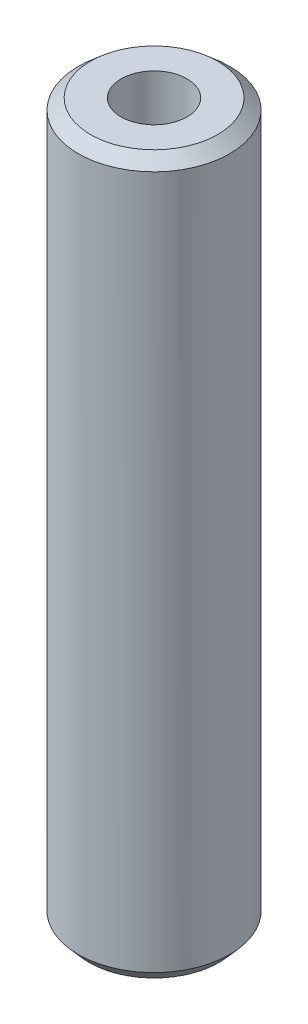
ISO-10303-21;
HEADER;
FILE_DESCRIPTION(('STEP AP214'),'2;1');
FILE_NAME('part.step','',(''),(''),'','','');
FILE_SCHEMA(('AUTOMOTIVE_DESIGN { 1 0 10303 214 1 1 1 1 }'));
ENDSEC;
DATA;
#1=APPLICATION_CONTEXT('core data for automotive mechanical design processes');
#2=APPLICATION_PROTOCOL_DEFINITION('international standard','automotive_design',2000,#1);
#3=PRODUCT_CONTEXT('',#1,'mechanical');
#4=PRODUCT('Part','Part','',(#3));
#5=PRODUCT_RELATED_PRODUCT_CATEGORY('part','',(#4));
#6=PRODUCT_DEFINITION_FORMATION('','',#4);
#7=PRODUCT_DEFINITION_CONTEXT('part definition',#1,'design');
#8=PRODUCT_DEFINITION('design','',#6,#7);
#9=PRODUCT_DEFINITION_SHAPE('','',#8);
#10=(LENGTH_UNIT() NAMED_UNIT(*) SI_UNIT(.MILLI.,.METRE.));
#11=(NAMED_UNIT(*) PLANE_ANGLE_UNIT() SI_UNIT($,.RADIAN.));
#12=(NAMED_UNIT(*) SI_UNIT($,.STERADIAN.) SOLID_ANGLE_UNIT());
#13=UNCERTAINTY_MEASURE_WITH_UNIT(LENGTH_MEASURE(1.E-05),#10,'distance_accuracy_value','');
#14=(GEOMETRIC_REPRESENTATION_CONTEXT(3) GLOBAL_UNCERTAINTY_ASSIGNED_CONTEXT((#13)) GLOBAL_UNIT_ASSIGNED_CONTEXT((#10,
#11,#12)) REPRESENTATION_CONTEXT('',''));
#15=CARTESIAN_POINT('',(0.,0.,0.));
#16=DIRECTION('',(0.,0.,1.));
#17=DIRECTION('',(1.,0.,0.));
#18=AXIS2_PLACEMENT_3D('',#15,#16,#17);
#19=CARTESIAN_POINT('',(0.,212.802195976553,0.));
#20=DIRECTION('',(0.,-1.,0.));
#21=DIRECTION('',(0.,0.,-1.));
#22=AXIS2_PLACEMENT_3D('',#19,#20,#21);
#23=CYLINDRICAL_SURFACE('',#22,22.5);
#24=CARTESIAN_POINT('',(0.,209.668713017492,0.));
#25=DIRECTION('',(0.,1.,0.));
#26=DIRECTION('',(0.,0.,1.));
#27=AXIS2_PLACEMENT_3D('',#24,#25,#26);
#28=CIRCLE('',#27,22.5);
#29=CARTESIAN_POINT('',(0.,209.668713017492,-22.5));
#30=VERTEX_POINT('',#29);
#31=EDGE_CURVE('E50',#30,#30,#28,.F.);
#32=ORIENTED_EDGE('',*,*,#31,.T.);
#33=EDGE_LOOP('',(#32));
#34=FACE_BOUND('',#33,.T.);
#35=CARTESIAN_POINT('',(0.,3.60356855964122,0.));
#36=DIRECTION('',(0.,1.,0.));
#37=DIRECTION('',(0.,0.,1.));
#38=AXIS2_PLACEMENT_3D('',#35,#36,#37);
#39=CIRCLE('',#38,22.5);
#40=CARTESIAN_POINT('',(0.,3.60356855964122,22.5));
#41=VERTEX_POINT('',#40);
#42=EDGE_CURVE('E51',#41,#41,#39,.T.);
#43=ORIENTED_EDGE('',*,*,#42,.T.);
#44=EDGE_LOOP('',(#43));
#45=FACE_BOUND('',#44,.T.);
#46=ADVANCED_FACE('F39',(#34,#45),#23,.T.);
#47=CARTESIAN_POINT('',(0.,212.802195976553,0.));
#48=DIRECTION('',(0.,1.,0.));
#49=DIRECTION('',(0.,0.,1.));
#50=AXIS2_PLACEMENT_3D('',#47,#48,#49);
#51=PLANE('',#50);
#52=CARTESIAN_POINT('',(0.,212.802195976553,0.));
#53=DIRECTION('',(0.,1.,0.));
#54=DIRECTION('',(0.,0.,1.));
#55=AXIS2_PLACEMENT_3D('',#52,#53,#54);
#56=CIRCLE('',#55,18.8964314403588);
#57=CARTESIAN_POINT('',(0.,212.802195976553,-18.8964314403588));
#58=VERTEX_POINT('',#57);
#59=EDGE_CURVE('E54',#58,#58,#56,.T.);
#60=ORIENTED_EDGE('',*,*,#59,.T.);
#61=EDGE_LOOP('',(#60));
#62=FACE_BOUND('',#61,.T.);
#63=CARTESIAN_POINT('',(0.,212.802195976553,0.));
#64=DIRECTION('',(0.,1.,0.));
#65=DIRECTION('',(0.,0.,1.));
#66=AXIS2_PLACEMENT_3D('',#63,#64,#65);
#67=CIRCLE('',#66,9.80738695314161);
#68=CARTESIAN_POINT('',(0.,212.802195976553,9.80738695314161));
#69=VERTEX_POINT('',#68);
#70=EDGE_CURVE('E58',#69,#69,#67,.T.);
#71=ORIENTED_EDGE('',*,*,#70,.F.);
#72=EDGE_LOOP('',(#71));
#73=FACE_BOUND('',#72,.T.);
#74=ADVANCED_FACE('F69',(#62,#73),#51,.T.);
#75=CARTESIAN_POINT('',(0.,0.,0.));
#76=DIRECTION('',(0.,1.,0.));
#77=DIRECTION('',(0.,0.,1.));
#78=AXIS2_PLACEMENT_3D('',#75,#76,#77);
#79=PLANE('',#78);
#80=CARTESIAN_POINT('',(0.,0.,0.));
#81=DIRECTION('',(0.,1.,0.));
#82=DIRECTION('',(0.,0.,1.));
#83=AXIS2_PLACEMENT_3D('',#80,#81,#82);
#84=CIRCLE('',#83,19.3665170409387);
#85=CARTESIAN_POINT('',(0.,0.,19.3665170409387));
#86=VERTEX_POINT('',#85);
#87=EDGE_CURVE('E10',#86,#86,#84,.F.);
#88=ORIENTED_EDGE('',*,*,#87,.T.);
#89=EDGE_LOOP('',(#88));
#90=FACE_BOUND('',#89,.T.);
#91=CARTESIAN_POINT('',(0.,0.,0.));
#92=DIRECTION('',(0.,1.,0.));
#93=DIRECTION('',(0.,0.,1.));
#94=AXIS2_PLACEMENT_3D('',#91,#92,#93);
#95=CIRCLE('',#94,9.80738695314161);
#96=CARTESIAN_POINT('',(0.,0.,9.80738695314161));
#97=VERTEX_POINT('',#96);
#98=EDGE_CURVE('E63',#97,#97,#95,.T.);
#99=ORIENTED_EDGE('',*,*,#98,.T.);
#100=EDGE_LOOP('',(#99));
#101=FACE_BOUND('',#100,.T.);
#102=ADVANCED_FACE('F75',(#90,#101),#79,.F.);
#103=CARTESIAN_POINT('',(0.,212.802195976553,0.));
#104=DIRECTION('',(0.,-1.,0.));
#105=DIRECTION('',(0.,0.,-1.));
#106=AXIS2_PLACEMENT_3D('',#103,#104,#105);
#107=CYLINDRICAL_SURFACE('',#106,9.80738695314161);
#108=ORIENTED_EDGE('',*,*,#70,.T.);
#109=EDGE_LOOP('',(#108));
#110=FACE_BOUND('',#109,.T.);
#111=ORIENTED_EDGE('',*,*,#98,.F.);
#112=EDGE_LOOP('',(#111));
#113=FACE_BOUND('',#112,.T.);
#114=ADVANCED_FACE('F70',(#110,#113),#107,.F.);
#115=CARTESIAN_POINT('',(0.,212.802195976553,0.));
#116=DIRECTION('',(0.,-1.,0.));
#117=DIRECTION('',(0.,0.,-1.));
#118=AXIS2_PLACEMENT_3D('',#115,#116,#117);
#119=CONICAL_SURFACE('',#118,18.8964314403588,0.855061415376436);
#120=CARTESIAN_POINT('',(0.,209.668713017492,-22.5));
#121=CARTESIAN_POINT('',(0.,209.701353464982,-22.4624628275038));
#122=CARTESIAN_POINT('',(0.,209.733993912472,-22.4249256550075));
#123=CARTESIAN_POINT('',(0.,209.799274807452,-22.349851310015));
#124=CARTESIAN_POINT('',(0.,209.831915254943,-22.3123141375187));
#125=CARTESIAN_POINT('',(0.,209.897196149923,-22.2372397925262));
#126=CARTESIAN_POINT('',(0.,209.929836597413,-22.1997026200299));
#127=CARTESIAN_POINT('',(0.,209.995117492394,-22.1246282750374));
#128=CARTESIAN_POINT('',(0.,210.027757939884,-22.0870911025411));
#129=CARTESIAN_POINT('',(0.,210.093038834864,-22.0120167575486));
#130=CARTESIAN_POINT('',(0.,210.125679282355,-21.9744795850523));
#131=CARTESIAN_POINT('',(0.,210.190960177335,-21.8994052400598));
#132=CARTESIAN_POINT('',(0.,210.223600624825,-21.8618680675636));
#133=CARTESIAN_POINT('',(0.,210.288881519806,-21.786793722571));
#134=CARTESIAN_POINT('',(0.,210.321521967296,-21.7492565500748));
#135=CARTESIAN_POINT('',(0.,210.386802862276,-21.6741822050822));
#136=CARTESIAN_POINT('',(0.,210.419443309767,-21.636645032586));
#137=CARTESIAN_POINT('',(0.,210.484724204747,-21.5615706875935));
#138=CARTESIAN_POINT('',(0.,210.517364652237,-21.5240335150972));
#139=CARTESIAN_POINT('',(0.,210.582645547218,-21.4489591701047));
#140=CARTESIAN_POINT('',(0.,210.615285994708,-21.4114219976084));
#141=CARTESIAN_POINT('',(0.,210.680566889688,-21.3363476526159));
#142=CARTESIAN_POINT('',(0.,210.713207337179,-21.2988104801196));
#143=CARTESIAN_POINT('',(0.,210.778488232159,-21.2237361351271));
#144=CARTESIAN_POINT('',(0.,210.811128679649,-21.1861989626308));
#145=CARTESIAN_POINT('',(0.,210.87640957463,-21.1111246176383));
#146=CARTESIAN_POINT('',(0.,210.90905002212,-21.073587445142));
#147=CARTESIAN_POINT('',(0.,210.9743309171,-20.9985131001495));
#148=CARTESIAN_POINT('',(0.,211.006971364591,-20.9609759276533));
#149=CARTESIAN_POINT('',(0.,211.072252259571,-20.8859015826607));
#150=CARTESIAN_POINT('',(0.,211.104892707061,-20.8483644101645));
#151=CARTESIAN_POINT('',(0.,211.170173602042,-20.773290065172));
#152=CARTESIAN_POINT('',(0.,211.202814049532,-20.7357528926757));
#153=CARTESIAN_POINT('',(0.,211.268094944512,-20.6606785476832));
#154=CARTESIAN_POINT('',(0.,211.300735392003,-20.6231413751869));
#155=CARTESIAN_POINT('',(0.,211.366016286983,-20.5480670301944));
#156=CARTESIAN_POINT('',(0.,211.398656734473,-20.5105298576981));
#157=CARTESIAN_POINT('',(0.,211.463937629454,-20.4354555127056));
#158=CARTESIAN_POINT('',(0.,211.496578076944,-20.3979183402093));
#159=CARTESIAN_POINT('',(0.,211.561858971924,-20.3228439952168));
#160=CARTESIAN_POINT('',(0.,211.594499419415,-20.2853068227205));
#161=CARTESIAN_POINT('',(0.,211.659780314395,-20.210232477728));
#162=CARTESIAN_POINT('',(0.,211.692420761885,-20.1726953052318));
#163=CARTESIAN_POINT('',(0.,211.757701656866,-20.0976209602392));
#164=CARTESIAN_POINT('',(0.,211.790342104356,-20.060083787743));
#165=CARTESIAN_POINT('',(0.,211.855622999336,-19.9850094427504));
#166=CARTESIAN_POINT('',(0.,211.888263446827,-19.9474722702542));
#167=CARTESIAN_POINT('',(0.,211.953544341807,-19.8723979252617));
#168=CARTESIAN_POINT('',(0.,211.986184789297,-19.8348607527654));
#169=CARTESIAN_POINT('',(0.,212.051465684278,-19.7597864077729));
#170=CARTESIAN_POINT('',(0.,212.084106131768,-19.7222492352766));
#171=CARTESIAN_POINT('',(0.,212.149387026748,-19.6471748902841));
#172=CARTESIAN_POINT('',(0.,212.182027474239,-19.6096377177878));
#173=CARTESIAN_POINT('',(0.,212.247308369219,-19.5345633727953));
#174=CARTESIAN_POINT('',(0.,212.279948816709,-19.497026200299));
#175=CARTESIAN_POINT('',(0.,212.34522971169,-19.4219518553065));
#176=CARTESIAN_POINT('',(0.,212.37787015918,-19.3844146828102));
#177=CARTESIAN_POINT('',(0.,212.44315105416,-19.3093403378177));
#178=CARTESIAN_POINT('',(0.,212.475791501651,-19.2718031653215));
#179=CARTESIAN_POINT('',(0.,212.541072396631,-19.1967288203289));
#180=CARTESIAN_POINT('',(0.,212.573712844121,-19.1591916478327));
#181=CARTESIAN_POINT('',(0.,212.638993739102,-19.0841173028402));
#182=CARTESIAN_POINT('',(0.,212.671634186592,-19.0465801303439));
#183=CARTESIAN_POINT('',(0.,212.736915081572,-18.9715057853514));
#184=CARTESIAN_POINT('',(0.,212.769555529063,-18.9339686128551));
#185=CARTESIAN_POINT('',(0.,212.802195976553,-18.8964314403588));
#186=B_SPLINE_CURVE_WITH_KNOTS('',3,(#120,#121,#122,#123,#124,#125,#126,#127,#128,#129,#130,
#131,#132,#133,#134,#135,#136,#137,#138,#139,#140,#141,#142,#143,#144,#145,#146,#147,#148,#149,
#150,#151,#152,#153,#154,#155,#156,#157,#158,#159,#160,#161,#162,#163,#164,#165,#166,#167,#168,
#169,#170,#171,#172,#173,#174,#175,#176,#177,#178,#179,#180,#181,#182,#183,#184,#185),
.UNSPECIFIED.,.F.,.F.,(4,2,2,2,2,2,2,2,2,2,2,2,2,2,2,2,2,2,2,2,2,2,2,2,2,2,2,2,2,2,2,2,4),(0.,
0.14923117362798,0.29846234725596,0.447693520883942,0.596924694511922,0.746155868139902,
0.895387041767882,1.04461821539586,1.19384938902384,1.34308056265182,1.4923117362798,
1.64154290990778,1.79077408353576,1.94000525716374,2.08923643079172,2.2384676044197,
2.38769877804768,2.53692995167566,2.68616112530364,2.83539229893162,2.9846234725596,
3.13385464618758,3.28308581981556,3.43231699344354,3.58154816707152,3.7307793406995,
3.88001051432748,4.02924168795546,4.17847286158344,4.32770403521142,4.4769352088394,
4.62616638246738,4.77539755609538),.UNSPECIFIED.);
#187=EDGE_CURVE('BSEAM81',#30,#58,#186,.T.);
#188=ORIENTED_EDGE('',*,*,#31,.F.);
#189=ORIENTED_EDGE('',*,*,#59,.F.);
#190=ORIENTED_EDGE('',*,*,#187,.T.);
#191=ORIENTED_EDGE('',*,*,#187,.F.);
#192=EDGE_LOOP('',(#188,#190,#189,#191));
#193=FACE_BOUND('',#192,.T.);
#194=ADVANCED_FACE('F81',(#193),#119,.T.);
#195=CARTESIAN_POINT('',(0.,3.60356855964122,0.));
#196=DIRECTION('',(0.,1.,0.));
#197=DIRECTION('',(0.,0.,1.));
#198=AXIS2_PLACEMENT_3D('',#195,#196,#197);
#199=CONICAL_SURFACE('',#198,22.5,0.715734911418461);
#200=ORIENTED_EDGE('',*,*,#87,.F.);
#201=EDGE_LOOP('',(#200));
#202=FACE_BOUND('',#201,.T.);
#203=ORIENTED_EDGE('',*,*,#42,.F.);
#204=EDGE_LOOP('',(#203));
#205=FACE_BOUND('',#204,.T.);
#206=ADVANCED_FACE('F45',(#202,#205),#199,.T.);
#207=CLOSED_SHELL('',(#46,#74,#102,#114,#194,#206));
#208=MANIFOLD_SOLID_BREP('B2',#207);
#209=ADVANCED_BREP_SHAPE_REPRESENTATION('',(#18,#208),#14);
#210=SHAPE_DEFINITION_REPRESENTATION(#9,#209);
ENDSEC;
END-ISO-10303-21;
